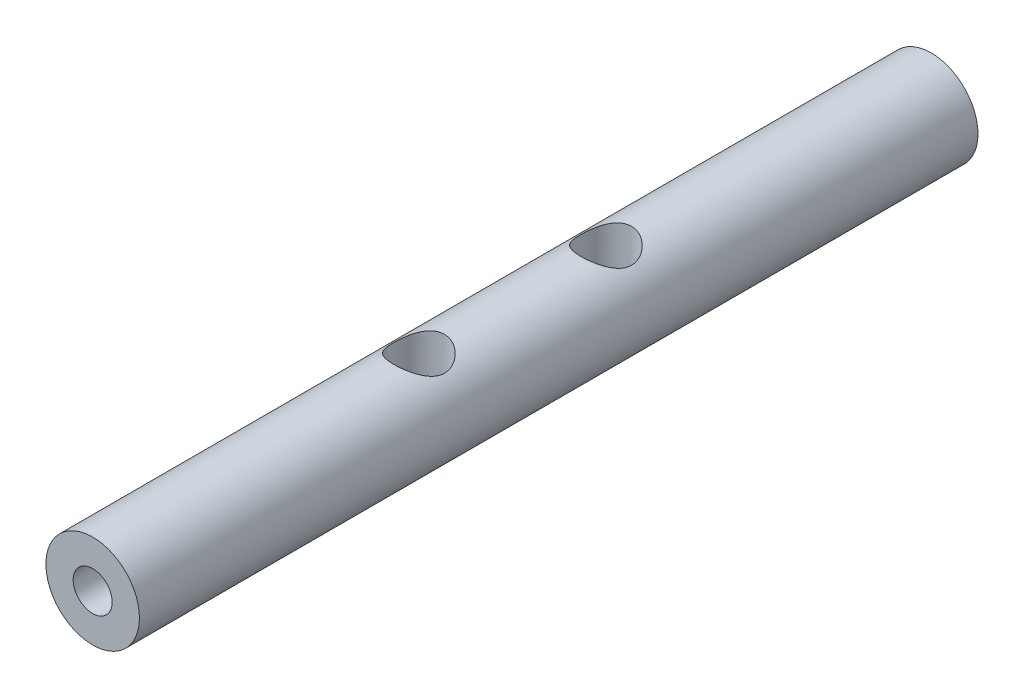
ISO-10303-21;
HEADER;
FILE_DESCRIPTION(('STEP AP214'),'2;1');
FILE_NAME('part.step','',(''),(''),'','','');
FILE_SCHEMA(('AUTOMOTIVE_DESIGN { 1 0 10303 214 1 1 1 1 }'));
ENDSEC;
DATA;
#1=APPLICATION_CONTEXT('core data for automotive mechanical design processes');
#2=APPLICATION_PROTOCOL_DEFINITION('international standard','automotive_design',2000,#1);
#3=PRODUCT_CONTEXT('',#1,'mechanical');
#4=PRODUCT('Part','Part','',(#3));
#5=PRODUCT_RELATED_PRODUCT_CATEGORY('part','',(#4));
#6=PRODUCT_DEFINITION_FORMATION('','',#4);
#7=PRODUCT_DEFINITION_CONTEXT('part definition',#1,'design');
#8=PRODUCT_DEFINITION('design','',#6,#7);
#9=PRODUCT_DEFINITION_SHAPE('','',#8);
#10=(LENGTH_UNIT() NAMED_UNIT(*) SI_UNIT(.MILLI.,.METRE.));
#11=(NAMED_UNIT(*) PLANE_ANGLE_UNIT() SI_UNIT($,.RADIAN.));
#12=(NAMED_UNIT(*) SI_UNIT($,.STERADIAN.) SOLID_ANGLE_UNIT());
#13=UNCERTAINTY_MEASURE_WITH_UNIT(LENGTH_MEASURE(1.E-05),#10,'distance_accuracy_value','');
#14=(GEOMETRIC_REPRESENTATION_CONTEXT(3) GLOBAL_UNCERTAINTY_ASSIGNED_CONTEXT((#13)) GLOBAL_UNIT_ASSIGNED_CONTEXT((#10,
#11,#12)) REPRESENTATION_CONTEXT('',''));
#15=CARTESIAN_POINT('',(0.,0.,0.));
#16=DIRECTION('',(0.,0.,1.));
#17=DIRECTION('',(1.,0.,0.));
#18=AXIS2_PLACEMENT_3D('',#15,#16,#17);
#19=CARTESIAN_POINT('',(0.,0.,53.8));
#20=DIRECTION('',(0.,0.,-1.));
#21=DIRECTION('',(-1.,0.,0.));
#22=AXIS2_PLACEMENT_3D('',#19,#20,#21);
#23=CYLINDRICAL_SURFACE('',#22,3.);
#24=CARTESIAN_POINT('',(-1.67418507985698,-2.48939838482801,32.9));
#25=CARTESIAN_POINT('',(-1.67417874792426,-2.48940739058473,32.9845622441242));
#26=CARTESIAN_POINT('',(-1.66768162039032,-2.49381038900441,33.0691984196438));
#27=CARTESIAN_POINT('',(-1.64207381243059,-2.51073943271135,33.2357580106561));
#28=CARTESIAN_POINT('',(-1.6229418667545,-2.52327917205968,33.3176766077371));
#29=CARTESIAN_POINT('',(-1.57320288394012,-2.55458050308205,33.4760581583417));
#30=CARTESIAN_POINT('',(-1.54266740017501,-2.57330321563424,33.5525516636398));
#31=CARTESIAN_POINT('',(-1.47119380414437,-2.61482174809998,33.6992707493233));
#32=CARTESIAN_POINT('',(-1.4302535240238,-2.63761841653423,33.7694950193788));
#33=CARTESIAN_POINT('',(-1.3342778342491,-2.68754754297471,33.9094930204861));
#34=CARTESIAN_POINT('',(-1.27823603774815,-2.71488534782135,33.9785038569203));
#35=CARTESIAN_POINT('',(-1.15569348346534,-2.76927248123174,34.1067154247562));
#36=CARTESIAN_POINT('',(-1.08918650640221,-2.79632162797831,34.1659102794456));
#37=CARTESIAN_POINT('',(-0.940625784082641,-2.84990744467537,34.277812787525));
#38=CARTESIAN_POINT('',(-0.857727483734366,-2.87620071495066,34.3295270891256));
#39=CARTESIAN_POINT('',(-0.682684010632217,-2.92268990867901,34.4178779061803));
#40=CARTESIAN_POINT('',(-0.590545950887645,-2.94289047516512,34.4545259108958));
#41=CARTESIAN_POINT('',(-0.407736299635145,-2.97348484942954,34.5084939847996));
#42=CARTESIAN_POINT('',(-0.317580176306482,-2.98455459598177,34.527168143272));
#43=CARTESIAN_POINT('',(-0.134810441981728,-2.9983663263465,34.5491747783519));
#44=CARTESIAN_POINT('',(-0.0421987477257337,-3.00111462317547,34.5525188859986));
#45=CARTESIAN_POINT('',(0.132429352758504,-2.99821425016596,34.5441598762631));
#46=CARTESIAN_POINT('',(0.214539773453571,-2.99341469963181,34.5339956989619));
#47=CARTESIAN_POINT('',(0.37573354194905,-2.97747948915032,34.5017438606667));
#48=CARTESIAN_POINT('',(0.454816656790294,-2.96634334262714,34.479655284026));
#49=CARTESIAN_POINT('',(0.60885125512767,-2.93862163898411,34.4241824045499));
#50=CARTESIAN_POINT('',(0.683749089382051,-2.92197870262914,34.3906790487451));
#51=CARTESIAN_POINT('',(0.827045974285331,-2.8846983403051,34.3135685538577));
#52=CARTESIAN_POINT('',(0.895442936238213,-2.86405963694208,34.2699581828149));
#53=CARTESIAN_POINT('',(1.03167649186099,-2.81804071928414,34.1685152499585));
#54=CARTESIAN_POINT('',(1.09865703409807,-2.79238919373229,34.1096560691274));
#55=CARTESIAN_POINT('',(1.22231271212904,-2.74052138418174,33.9820757945502));
#56=CARTESIAN_POINT('',(1.27897711218389,-2.71430454323987,33.9133445587415));
#57=CARTESIAN_POINT('',(1.38533740495156,-2.66170259771836,33.7607020457706));
#58=CARTESIAN_POINT('',(1.43398478700822,-2.63550478403824,33.6759878250235));
#59=CARTESIAN_POINT('',(1.51595850276516,-2.58922818184214,33.4979123412443));
#60=CARTESIAN_POINT('',(1.54930254915191,-2.56914232822605,33.4045612261049));
#61=CARTESIAN_POINT('',(1.59680433899241,-2.5398707484805,33.2196175660859));
#62=CARTESIAN_POINT('',(1.61229454946542,-2.52993547804829,33.1284922928188));
#63=CARTESIAN_POINT('',(1.62764852295886,-2.52009114078003,32.9444385673955));
#64=CARTESIAN_POINT('',(1.62753015522791,-2.52017060871508,32.8515122989948));
#65=CARTESIAN_POINT('',(1.61289089615575,-2.52955026942772,32.6810193032245));
#66=CARTESIAN_POINT('',(1.60046585342937,-2.53750858867493,32.6031832372118));
#67=CARTESIAN_POINT('',(1.56491807256443,-2.55958319011467,32.4509051572916));
#68=CARTESIAN_POINT('',(1.54179063920735,-2.57370217488172,32.3764646488028));
#69=CARTESIAN_POINT('',(1.48456367751867,-2.60714531993856,32.2294315856593));
#70=CARTESIAN_POINT('',(1.45004275925545,-2.62666379642748,32.157049179305));
#71=CARTESIAN_POINT('',(1.37137345744475,-2.66858034642967,32.018638467017));
#72=CARTESIAN_POINT('',(1.32722031090996,-2.69097984230528,31.9526133280174));
#73=CARTESIAN_POINT('',(1.22242441018721,-2.74035353776672,31.8178240171669));
#74=CARTESIAN_POINT('',(1.16027742558986,-2.76749024986919,31.7502833445464));
#75=CARTESIAN_POINT('',(1.02532772026233,-2.82027586545178,31.6260553654176));
#76=CARTESIAN_POINT('',(0.952518794792583,-2.84592389036791,31.5693744233941));
#77=CARTESIAN_POINT('',(0.79360034680166,-2.89437955925455,31.4658164352217));
#78=CARTESIAN_POINT('',(0.707004382975046,-2.91697795085138,31.4195801922183));
#79=CARTESIAN_POINT('',(0.525678555358574,-2.95503131680498,31.3427856946241));
#80=CARTESIAN_POINT('',(0.430957268763268,-2.9704937165935,31.3122111394385));
#81=CARTESIAN_POINT('',(0.246463961170265,-2.99115018242156,31.2706938816082));
#82=CARTESIAN_POINT('',(0.157170234763477,-2.99722957769689,31.2580690306557));
#83=CARTESIAN_POINT('',(-0.0224475607861199,-3.00125771646269,31.2475681065655));
#84=CARTESIAN_POINT('',(-0.112771062127573,-2.99921074319971,31.2496842641804));
#85=CARTESIAN_POINT('',(-0.283303701004868,-2.98770708487821,31.2676699284619));
#86=CARTESIAN_POINT('',(-0.363695460978917,-2.97892880625263,31.2822936667943));
#87=CARTESIAN_POINT('',(-0.520630838422349,-2.95554395862078,31.3229648219905));
#88=CARTESIAN_POINT('',(-0.597173995506868,-2.94093669418744,31.3490136019554));
#89=CARTESIAN_POINT('',(-0.747260971645303,-2.9064987829693,31.4126126320396));
#90=CARTESIAN_POINT('',(-0.820612829991331,-2.8865066559362,31.450525594045));
#91=CARTESIAN_POINT('',(-0.960119649881503,-2.84315230805189,31.5363255014877));
#92=CARTESIAN_POINT('',(-1.02627168433711,-2.81978872544686,31.5842164805995));
#93=CARTESIAN_POINT('',(-1.15758729979251,-2.7686652636432,31.6949260016504));
#94=CARTESIAN_POINT('',(-1.22176243656416,-2.74070878837433,31.7588278337257));
#95=CARTESIAN_POINT('',(-1.33897177517596,-2.68539850118267,31.8965071375519));
#96=CARTESIAN_POINT('',(-1.39199240252005,-2.65804545941396,31.9702964652734));
#97=CARTESIAN_POINT('',(-1.48875697605896,-2.60515655975889,32.1317240000514));
#98=CARTESIAN_POINT('',(-1.53165134557677,-2.57986190765574,32.2199563985927));
#99=CARTESIAN_POINT('',(-1.60144491637929,-2.53713990963379,32.4041788004087));
#100=CARTESIAN_POINT('',(-1.62839509530135,-2.51968753347401,32.5001429528282));
#101=CARTESIAN_POINT('',(-1.65569872000885,-2.5017532712973,32.6478087830585));
#102=CARTESIAN_POINT('',(-1.66261401752616,-2.49714746169083,32.69787476416));
#103=CARTESIAN_POINT('',(-1.67185904495401,-2.49096735210302,32.7986183124075));
#104=CARTESIAN_POINT('',(-1.6741888765297,-2.48939298491105,32.8492958659691));
#105=CARTESIAN_POINT('',(-1.67418507985698,-2.48939838482801,32.9));
#106=B_SPLINE_CURVE_WITH_KNOTS('',3,(#24,#25,#26,#27,#28,#29,#30,#31,#32,#33,#34,#35,#36,#37,
#38,#39,#40,#41,#42,#43,#44,#45,#46,#47,#48,#49,#50,#51,#52,#53,#54,#55,#56,#57,#58,#59,#60,#61,
#62,#63,#64,#65,#66,#67,#68,#69,#70,#71,#72,#73,#74,#75,#76,#77,#78,#79,#80,#81,#82,#83,#84,#85,
#86,#87,#88,#89,#90,#91,#92,#93,#94,#95,#96,#97,#98,#99,#100,#101,#102,#103,#104,#105),
.UNSPECIFIED.,.T.,.F.,(4,2,2,2,2,2,2,2,2,2,2,2,2,2,2,2,2,2,2,2,2,2,2,2,2,2,2,2,2,2,2,2,2,2,2,2,
2,2,2,2,4),(0.,0.253471464978924,0.507370630471961,0.759702723718418,1.0120874338999,
1.28998079678324,1.56803993512379,1.86997289364919,2.17167517502775,2.44828286528194,
2.72468065617496,2.97213663093978,3.21961160997026,3.46975098230536,3.71997045333203,
3.99717687977861,4.27467015892954,4.57652503396564,4.87802964361057,5.15517475627459,
5.43200258623575,5.66859462056204,5.90529054812096,6.15196333618104,6.39875837770519,
6.68465599353127,6.9707206542103,7.27125286686228,7.57147164850529,7.84111747203328,
8.11062118950825,8.35604451303949,8.60149712555493,8.855339906974,9.10928550569669,
9.39243346006442,9.67592402360681,9.97823556729928,10.279575245972,10.4315619419379,
10.583545268142),.UNSPECIFIED.);
#107=CARTESIAN_POINT('',(-1.67418507985698,-2.48939838482801,32.9));
#108=VERTEX_POINT('',#107);
#109=EDGE_CURVE('E41',#108,#108,#106,.T.);
#110=ORIENTED_EDGE('',*,*,#109,.T.);
#111=EDGE_LOOP('',(#110));
#112=FACE_BOUND('',#111,.T.);
#113=CARTESIAN_POINT('',(-1.62566018942524,2.52135458603463,32.9));
#114=CARTESIAN_POINT('',(-1.6256536842702,2.52136346747506,32.8154377558758));
#115=CARTESIAN_POINT('',(-1.61907250464969,2.52563981358811,32.7308015803562));
#116=CARTESIAN_POINT('',(-1.59314164328522,2.54206974901801,32.5642419893439));
#117=CARTESIAN_POINT('',(-1.57377043507337,2.55423661799445,32.4823233922629));
#118=CARTESIAN_POINT('',(-1.52343458389827,2.58456880917247,32.3239418416583));
#119=CARTESIAN_POINT('',(-1.4925422338405,2.60269664528132,32.2474483363602));
#120=CARTESIAN_POINT('',(-1.42027797443758,2.64282319859216,32.1007292506767));
#121=CARTESIAN_POINT('',(-1.37890388121111,2.66482272217197,32.0305049806212));
#122=CARTESIAN_POINT('',(-1.28197923972725,2.71288377259812,31.8905069795139));
#123=CARTESIAN_POINT('',(-1.22541851652206,2.73913111759515,31.8214961430797));
#124=CARTESIAN_POINT('',(-1.10184565715998,2.79113483207626,31.6932845752439));
#125=CARTESIAN_POINT('',(-1.03482730640939,2.81689089933164,31.6340897205544));
#126=CARTESIAN_POINT('',(-0.885256677354983,2.86758956688289,31.522187212475));
#127=CARTESIAN_POINT('',(-0.801864716150481,2.89227245708783,31.4704729108744));
#128=CARTESIAN_POINT('',(-0.625953739753542,2.93536295479036,31.3821220938197));
#129=CARTESIAN_POINT('',(-0.533441746317141,2.95377534220419,31.3454740891043));
#130=CARTESIAN_POINT('',(-0.350073875108627,2.98082359789934,31.2915060152004));
#131=CARTESIAN_POINT('',(-0.259720278281573,2.99014526099119,31.2728318567281));
#132=CARTESIAN_POINT('',(-0.0767173373621651,3.0004147933884,31.2508252216481));
#133=CARTESIAN_POINT('',(0.0159302126105213,3.00136901164676,31.2474811140014));
#134=CARTESIAN_POINT('',(0.190469391910898,2.99508724983352,31.2558401237369));
#135=CARTESIAN_POINT('',(0.272471462530794,2.98869840908574,31.266004301038));
#136=CARTESIAN_POINT('',(0.433326390419499,2.96964443026812,31.2982561393333));
#137=CARTESIAN_POINT('',(0.51217900534957,2.95697881022529,31.320344715974));
#138=CARTESIAN_POINT('',(0.665647842806608,2.92627919675193,31.3758175954501));
#139=CARTESIAN_POINT('',(0.740209314919446,2.90818887384495,31.4093209512549));
#140=CARTESIAN_POINT('',(0.882757335143963,2.8681403461808,31.4864314461423));
#141=CARTESIAN_POINT('',(0.950741770212723,2.84618090471995,31.5300418171851));
#142=CARTESIAN_POINT('',(1.08605855075542,2.79753225249203,31.6314847500415));
#143=CARTESIAN_POINT('',(1.15252975100144,2.77058836006047,31.6903439308726));
#144=CARTESIAN_POINT('',(1.27515774042167,2.71633550218531,31.8179242054498));
#145=CARTESIAN_POINT('',(1.33130378508428,2.68902618781653,31.8866554412585));
#146=CARTESIAN_POINT('',(1.43662541532149,2.63437428250257,32.0392979542294));
#147=CARTESIAN_POINT('',(1.48475631405271,2.60723925329842,32.1240121749765));
#148=CARTESIAN_POINT('',(1.56581844060922,2.55938378732062,32.3020876587557));
#149=CARTESIAN_POINT('',(1.59876724097284,2.53865594373942,32.3954387738951));
#150=CARTESIAN_POINT('',(1.64569323429219,2.50846991104474,32.5803824339141));
#151=CARTESIAN_POINT('',(1.66098812832599,2.49823651299941,32.6715077071812));
#152=CARTESIAN_POINT('',(1.67614857198709,2.48809666949534,32.8555614326045));
#153=CARTESIAN_POINT('',(1.67603176547046,2.48817841489341,32.9484877010052));
#154=CARTESIAN_POINT('',(1.66157690303512,2.49783982748377,33.1189806967755));
#155=CARTESIAN_POINT('',(1.64930831528333,2.50603728358732,33.1968167627882));
#156=CARTESIAN_POINT('',(1.61419470880551,2.5287961806007,33.3490948427084));
#157=CARTESIAN_POINT('',(1.5913450480809,2.54336041450808,33.4235353511972));
#158=CARTESIAN_POINT('',(1.53477649541337,2.57790557255535,33.5705684143407));
#159=CARTESIAN_POINT('',(1.50064005579172,2.59808893729322,33.642950820695));
#160=CARTESIAN_POINT('',(1.422797284553,2.6415211739078,33.781361532983));
#161=CARTESIAN_POINT('',(1.37908621838808,2.66477156012244,33.8473866719826));
#162=CARTESIAN_POINT('',(1.27526616693577,2.71616552405061,33.982175982833));
#163=CARTESIAN_POINT('',(1.21365638065084,2.74450071545991,34.0497166554536));
#164=CARTESIAN_POINT('',(1.07975425678434,2.7998899328624,34.1739446345824));
#165=CARTESIAN_POINT('',(1.00745569861218,2.82694320062038,34.2306255766059));
#166=CARTESIAN_POINT('',(0.849505471517208,2.87846747373262,34.3341835647783));
#167=CARTESIAN_POINT('',(0.763363400036767,2.90273868661706,34.3804198077817));
#168=CARTESIAN_POINT('',(0.582808539715165,2.94429655994384,34.4572143053759));
#169=CARTESIAN_POINT('',(0.488404470264447,2.96159047831517,34.4877888605615));
#170=CARTESIAN_POINT('',(0.304345807188164,2.98581605722845,34.5293061183918));
#171=CARTESIAN_POINT('',(0.215186564167075,2.99362361807871,34.5419309693443));
#172=CARTESIAN_POINT('',(0.0356804664689837,3.00112956700051,34.5524318934345));
#173=CARTESIAN_POINT('',(-0.0546657375617162,3.00083222651896,34.5503157358196));
#174=CARTESIAN_POINT('',(-0.225389178830067,2.99263334374607,34.5323300715381));
#175=CARTESIAN_POINT('',(-0.305935865906382,2.9854136174089,34.5177063332057));
#176=CARTESIAN_POINT('',(-0.463294692773116,2.96507244243786,34.4770351780095));
#177=CARTESIAN_POINT('',(-0.540106385732993,2.95195028959132,34.4509863980446));
#178=CARTESIAN_POINT('',(-0.690832154706123,2.92042549454192,34.3873873679604));
#179=CARTESIAN_POINT('',(-0.764557433318391,2.90185768477159,34.349474405955));
#180=CARTESIAN_POINT('',(-0.904877710381227,2.8612132248619,34.2636744985123));
#181=CARTESIAN_POINT('',(-0.971469808664617,2.83913515653667,34.2157835194005));
#182=CARTESIAN_POINT('',(-1.10375087797698,2.79056440493862,34.1050739983496));
#183=CARTESIAN_POINT('',(-1.16845539753368,2.76385601977489,34.0411721662743));
#184=CARTESIAN_POINT('',(-1.28671391970394,2.71082603899847,33.9034928624481));
#185=CARTESIAN_POINT('',(-1.34025433545212,2.68450495050512,33.8297035347266));
#186=CARTESIAN_POINT('',(-1.43802503315482,2.63349995987072,33.6682759999485));
#187=CARTESIAN_POINT('',(-1.48140122646018,2.60904076495989,33.5800436014073));
#188=CARTESIAN_POINT('',(-1.55200908261987,2.56767843561437,33.3958211995913));
#189=CARTESIAN_POINT('',(-1.57929219829861,2.55075126289079,33.2998570471718));
#190=CARTESIAN_POINT('',(-1.60693802591382,2.53334913953009,33.1521912169415));
#191=CARTESIAN_POINT('',(-1.61394122483089,2.52887811875045,33.10212523584));
#192=CARTESIAN_POINT('',(-1.62330420538177,2.52287821192929,33.0013816875925));
#193=CARTESIAN_POINT('',(-1.62566408996332,2.52134926065863,32.9507041340309));
#194=CARTESIAN_POINT('',(-1.62566018942524,2.52135458603463,32.9));
#195=B_SPLINE_CURVE_WITH_KNOTS('',3,(#113,#114,#115,#116,#117,#118,#119,#120,#121,#122,#123,
#124,#125,#126,#127,#128,#129,#130,#131,#132,#133,#134,#135,#136,#137,#138,#139,#140,#141,#142,
#143,#144,#145,#146,#147,#148,#149,#150,#151,#152,#153,#154,#155,#156,#157,#158,#159,#160,#161,
#162,#163,#164,#165,#166,#167,#168,#169,#170,#171,#172,#173,#174,#175,#176,#177,#178,#179,#180,
#181,#182,#183,#184,#185,#186,#187,#188,#189,#190,#191,#192,#193,#194),.UNSPECIFIED.,.T.,.F.,(4,
2,2,2,2,2,2,2,2,2,2,2,2,2,2,2,2,2,2,2,2,2,2,2,2,2,2,2,2,2,2,2,2,2,2,2,2,2,2,2,4),(0.,
0.253471464978924,0.507370630471962,0.759702723718419,1.0120874338999,1.28998079678323,
1.56803993512378,1.86997289364918,2.17167517502775,2.44828286528194,2.72468065617496,
2.97213663093978,3.21961160997025,3.46975098230535,3.71997045333202,3.99717687977861,
4.27467015892954,4.57652503396563,4.87802964361057,5.15517475627459,5.43200258623575,
5.66859462056203,5.90529054812095,6.15196333618103,6.39875837770518,6.68465599353126,
6.9707206542103,7.27125286686227,7.57147164850529,7.84111747203328,8.11062118950825,
8.35604451303949,8.60149712555493,8.855339906974,9.10928550569669,9.39243346006442,
9.67592402360681,9.97823556729927,10.279575245972,10.4315619419379,10.583545268142),.UNSPECIFIED.);
#196=CARTESIAN_POINT('',(-1.62566018942524,2.52135458603463,32.9));
#197=VERTEX_POINT('',#196);
#198=EDGE_CURVE('E11',#197,#197,#195,.T.);
#199=ORIENTED_EDGE('',*,*,#198,.T.);
#200=EDGE_LOOP('',(#199));
#201=FACE_BOUND('',#200,.T.);
#202=CARTESIAN_POINT('',(-1.67418507985698,-2.489398384828,20.9));
#203=CARTESIAN_POINT('',(-1.67417874792426,-2.48940739058473,20.9845622441242));
#204=CARTESIAN_POINT('',(-1.66768162039032,-2.49381038900441,21.0691984196437));
#205=CARTESIAN_POINT('',(-1.64207381243059,-2.51073943271135,21.2357580106561));
#206=CARTESIAN_POINT('',(-1.6229418667545,-2.52327917205968,21.3176766077371));
#207=CARTESIAN_POINT('',(-1.57320288394012,-2.55458050308205,21.4760581583416));
#208=CARTESIAN_POINT('',(-1.54266740017501,-2.57330321563424,21.5525516636398));
#209=CARTESIAN_POINT('',(-1.47119380414437,-2.61482174809998,21.6992707493233));
#210=CARTESIAN_POINT('',(-1.43025352402381,-2.63761841653423,21.7694950193788));
#211=CARTESIAN_POINT('',(-1.3342778342491,-2.68754754297471,21.9094930204861));
#212=CARTESIAN_POINT('',(-1.27823603774815,-2.71488534782135,21.9785038569203));
#213=CARTESIAN_POINT('',(-1.15569348346535,-2.76927248123174,22.1067154247562));
#214=CARTESIAN_POINT('',(-1.08918650640222,-2.79632162797831,22.1659102794456));
#215=CARTESIAN_POINT('',(-0.940625784082646,-2.84990744467537,22.277812787525));
#216=CARTESIAN_POINT('',(-0.85772748373437,-2.87620071495066,22.3295270891256));
#217=CARTESIAN_POINT('',(-0.682684010632218,-2.92268990867901,22.4178779061803));
#218=CARTESIAN_POINT('',(-0.590545950887645,-2.94289047516512,22.4545259108958));
#219=CARTESIAN_POINT('',(-0.407736299635143,-2.97348484942954,22.5084939847996));
#220=CARTESIAN_POINT('',(-0.31758017630648,-2.98455459598177,22.5271681432719));
#221=CARTESIAN_POINT('',(-0.134810441981726,-2.9983663263465,22.5491747783519));
#222=CARTESIAN_POINT('',(-0.0421987477257311,-3.00111462317547,22.5525188859986));
#223=CARTESIAN_POINT('',(0.132429352758507,-2.99821425016596,22.5441598762631));
#224=CARTESIAN_POINT('',(0.214539773453574,-2.99341469963181,22.533995698962));
#225=CARTESIAN_POINT('',(0.375733541949052,-2.97747948915032,22.5017438606667));
#226=CARTESIAN_POINT('',(0.454816656790295,-2.96634334262714,22.479655284026));
#227=CARTESIAN_POINT('',(0.608851255127672,-2.93862163898411,22.4241824045499));
#228=CARTESIAN_POINT('',(0.683749089382054,-2.92197870262914,22.3906790487451));
#229=CARTESIAN_POINT('',(0.827045974285334,-2.8846983403051,22.3135685538577));
#230=CARTESIAN_POINT('',(0.895442936238214,-2.86405963694208,22.2699581828149));
#231=CARTESIAN_POINT('',(1.031676491861,-2.81804071928414,22.1685152499585));
#232=CARTESIAN_POINT('',(1.09865703409807,-2.79238919373229,22.1096560691274));
#233=CARTESIAN_POINT('',(1.22231271212904,-2.74052138418174,21.9820757945502));
#234=CARTESIAN_POINT('',(1.27897711218389,-2.71430454323987,21.9133445587415));
#235=CARTESIAN_POINT('',(1.38533740495156,-2.66170259771836,21.7607020457706));
#236=CARTESIAN_POINT('',(1.43398478700822,-2.63550478403824,21.6759878250235));
#237=CARTESIAN_POINT('',(1.51595850276516,-2.58922818184214,21.4979123412443));
#238=CARTESIAN_POINT('',(1.54930254915191,-2.56914232822605,21.4045612261049));
#239=CARTESIAN_POINT('',(1.59680433899241,-2.5398707484805,21.2196175660859));
#240=CARTESIAN_POINT('',(1.61229454946543,-2.52993547804829,21.1284922928188));
#241=CARTESIAN_POINT('',(1.62764852295886,-2.52009114078003,20.9444385673954));
#242=CARTESIAN_POINT('',(1.62753015522791,-2.52017060871508,20.8515122989948));
#243=CARTESIAN_POINT('',(1.61289089615575,-2.52955026942772,20.6810193032245));
#244=CARTESIAN_POINT('',(1.60046585342937,-2.53750858867493,20.6031832372118));
#245=CARTESIAN_POINT('',(1.56491807256443,-2.55958319011467,20.4509051572916));
#246=CARTESIAN_POINT('',(1.54179063920735,-2.57370217488172,20.3764646488028));
#247=CARTESIAN_POINT('',(1.48456367751867,-2.60714531993856,20.2294315856593));
#248=CARTESIAN_POINT('',(1.45004275925545,-2.62666379642748,20.157049179305));
#249=CARTESIAN_POINT('',(1.37137345744475,-2.66858034642967,20.018638467017));
#250=CARTESIAN_POINT('',(1.32722031090996,-2.69097984230528,19.9526133280174));
#251=CARTESIAN_POINT('',(1.22242441018722,-2.74035353776672,19.8178240171669));
#252=CARTESIAN_POINT('',(1.16027742558986,-2.76749024986919,19.7502833445464));
#253=CARTESIAN_POINT('',(1.02532772026233,-2.82027586545178,19.6260553654176));
#254=CARTESIAN_POINT('',(0.952518794792583,-2.84592389036791,19.5693744233941));
#255=CARTESIAN_POINT('',(0.793600346801659,-2.89437955925456,19.4658164352217));
#256=CARTESIAN_POINT('',(0.707004382975045,-2.91697795085138,19.4195801922183));
#257=CARTESIAN_POINT('',(0.525678555358573,-2.95503131680498,19.3427856946241));
#258=CARTESIAN_POINT('',(0.430957268763267,-2.9704937165935,19.3122111394385));
#259=CARTESIAN_POINT('',(0.246463961170264,-2.99115018242156,19.2706938816082));
#260=CARTESIAN_POINT('',(0.157170234763476,-2.99722957769689,19.2580690306557));
#261=CARTESIAN_POINT('',(-0.0224475607861208,-3.00125771646269,19.2475681065655));
#262=CARTESIAN_POINT('',(-0.112771062127574,-2.99921074319971,19.2496842641804));
#263=CARTESIAN_POINT('',(-0.283303701004869,-2.98770708487821,19.2676699284619));
#264=CARTESIAN_POINT('',(-0.363695460978917,-2.97892880625263,19.2822936667944));
#265=CARTESIAN_POINT('',(-0.52063083842235,-2.95554395862078,19.3229648219905));
#266=CARTESIAN_POINT('',(-0.597173995506869,-2.94093669418744,19.3490136019554));
#267=CARTESIAN_POINT('',(-0.747260971645304,-2.9064987829693,19.4126126320396));
#268=CARTESIAN_POINT('',(-0.820612829991333,-2.8865066559362,19.450525594045));
#269=CARTESIAN_POINT('',(-0.960119649881505,-2.84315230805189,19.5363255014877));
#270=CARTESIAN_POINT('',(-1.02627168433711,-2.81978872544686,19.5842164805995));
#271=CARTESIAN_POINT('',(-1.15758729979252,-2.76866526364319,19.6949260016504));
#272=CARTESIAN_POINT('',(-1.22176243656416,-2.74070878837433,19.7588278337257));
#273=CARTESIAN_POINT('',(-1.33897177517597,-2.68539850118267,19.8965071375519));
#274=CARTESIAN_POINT('',(-1.39199240252006,-2.65804545941396,19.9702964652734));
#275=CARTESIAN_POINT('',(-1.48875697605896,-2.60515655975889,20.1317240000515));
#276=CARTESIAN_POINT('',(-1.53165134557677,-2.57986190765574,20.2199563985927));
#277=CARTESIAN_POINT('',(-1.60144491637929,-2.53713990963379,20.4041788004087));
#278=CARTESIAN_POINT('',(-1.62839509530135,-2.51968753347401,20.5001429528282));
#279=CARTESIAN_POINT('',(-1.65569872000885,-2.5017532712973,20.6478087830585));
#280=CARTESIAN_POINT('',(-1.66261401752617,-2.49714746169083,20.69787476416));
#281=CARTESIAN_POINT('',(-1.67185904495401,-2.49096735210302,20.7986183124075));
#282=CARTESIAN_POINT('',(-1.6741888765297,-2.48939298491105,20.8492958659691));
#283=CARTESIAN_POINT('',(-1.67418507985698,-2.489398384828,20.9));
#284=B_SPLINE_CURVE_WITH_KNOTS('',3,(#202,#203,#204,#205,#206,#207,#208,#209,#210,#211,#212,
#213,#214,#215,#216,#217,#218,#219,#220,#221,#222,#223,#224,#225,#226,#227,#228,#229,#230,#231,
#232,#233,#234,#235,#236,#237,#238,#239,#240,#241,#242,#243,#244,#245,#246,#247,#248,#249,#250,
#251,#252,#253,#254,#255,#256,#257,#258,#259,#260,#261,#262,#263,#264,#265,#266,#267,#268,#269,
#270,#271,#272,#273,#274,#275,#276,#277,#278,#279,#280,#281,#282,#283),.UNSPECIFIED.,.T.,.F.,(4,
2,2,2,2,2,2,2,2,2,2,2,2,2,2,2,2,2,2,2,2,2,2,2,2,2,2,2,2,2,2,2,2,2,2,2,2,2,2,2,4),(0.,
0.253471464978914,0.507370630471961,0.759702723718411,1.0120874338999,1.28998079678323,
1.56803993512378,1.86997289364919,2.17167517502775,2.44828286528194,2.72468065617496,
2.97213663093978,3.21961160997026,3.46975098230536,3.71997045333203,3.99717687977861,
4.27467015892954,4.57652503396564,4.87802964361058,5.1551747562746,5.43200258623576,
5.66859462056205,5.90529054812097,6.15196333618105,6.3987583777052,6.68465599353128,
6.97072065421031,7.27125286686229,7.5714716485053,7.84111747203329,8.11062118950826,
8.3560445130395,8.60149712555494,8.85533990697401,9.1092855056967,9.39243346006443,
9.67592402360683,9.97823556729928,10.279575245972,10.4315619419379,10.5835452681421),.UNSPECIFIED.);
#285=CARTESIAN_POINT('',(-1.67418507985698,-2.489398384828,20.9));
#286=VERTEX_POINT('',#285);
#287=EDGE_CURVE('E83',#286,#286,#284,.T.);
#288=ORIENTED_EDGE('',*,*,#287,.T.);
#289=EDGE_LOOP('',(#288));
#290=FACE_BOUND('',#289,.T.);
#291=CARTESIAN_POINT('',(-1.62566018942525,2.52135458603463,20.9));
#292=CARTESIAN_POINT('',(-1.6256536842702,2.52136346747506,20.8154377558758));
#293=CARTESIAN_POINT('',(-1.61907250464969,2.52563981358811,20.7308015803563));
#294=CARTESIAN_POINT('',(-1.59314164328523,2.54206974901801,20.5642419893439));
#295=CARTESIAN_POINT('',(-1.57377043507337,2.55423661799445,20.4823233922629));
#296=CARTESIAN_POINT('',(-1.52343458389827,2.58456880917246,20.3239418416584));
#297=CARTESIAN_POINT('',(-1.49254223384051,2.60269664528132,20.2474483363602));
#298=CARTESIAN_POINT('',(-1.42027797443759,2.64282319859216,20.1007292506767));
#299=CARTESIAN_POINT('',(-1.37890388121111,2.66482272217196,20.0305049806212));
#300=CARTESIAN_POINT('',(-1.28197923972725,2.71288377259811,19.8905069795139));
#301=CARTESIAN_POINT('',(-1.22541851652206,2.73913111759514,19.8214961430797));
#302=CARTESIAN_POINT('',(-1.10184565715999,2.79113483207626,19.6932845752439));
#303=CARTESIAN_POINT('',(-1.03482730640939,2.81689089933164,19.6340897205544));
#304=CARTESIAN_POINT('',(-0.885256677354989,2.86758956688289,19.522187212475));
#305=CARTESIAN_POINT('',(-0.801864716150488,2.89227245708783,19.4704729108744));
#306=CARTESIAN_POINT('',(-0.62595373975355,2.93536295479036,19.3821220938197));
#307=CARTESIAN_POINT('',(-0.533441746317148,2.95377534220419,19.3454740891043));
#308=CARTESIAN_POINT('',(-0.350073875108634,2.98082359789934,19.2915060152004));
#309=CARTESIAN_POINT('',(-0.25972027828158,2.99014526099119,19.2728318567281));
#310=CARTESIAN_POINT('',(-0.0767173373621731,3.00041479338841,19.2508252216481));
#311=CARTESIAN_POINT('',(0.0159302126105133,3.00136901164676,19.2474811140014));
#312=CARTESIAN_POINT('',(0.190469391910891,2.99508724983352,19.2558401237369));
#313=CARTESIAN_POINT('',(0.272471462530787,2.98869840908574,19.266004301038));
#314=CARTESIAN_POINT('',(0.433326390419493,2.96964443026812,19.2982561393333));
#315=CARTESIAN_POINT('',(0.512179005349563,2.95697881022529,19.320344715974));
#316=CARTESIAN_POINT('',(0.665647842806602,2.92627919675193,19.3758175954501));
#317=CARTESIAN_POINT('',(0.740209314919441,2.90818887384495,19.4093209512549));
#318=CARTESIAN_POINT('',(0.882757335143959,2.8681403461808,19.4864314461423));
#319=CARTESIAN_POINT('',(0.950741770212718,2.84618090471995,19.5300418171851));
#320=CARTESIAN_POINT('',(1.08605855075542,2.79753225249203,19.6314847500415));
#321=CARTESIAN_POINT('',(1.15252975100144,2.77058836006048,19.6903439308726));
#322=CARTESIAN_POINT('',(1.27515774042167,2.71633550218531,19.8179242054498));
#323=CARTESIAN_POINT('',(1.33130378508428,2.68902618781653,19.8866554412585));
#324=CARTESIAN_POINT('',(1.43662541532149,2.63437428250257,20.0392979542294));
#325=CARTESIAN_POINT('',(1.48475631405271,2.60723925329842,20.1240121749765));
#326=CARTESIAN_POINT('',(1.56581844060922,2.55938378732062,20.3020876587557));
#327=CARTESIAN_POINT('',(1.59876724097284,2.53865594373942,20.3954387738951));
#328=CARTESIAN_POINT('',(1.64569323429219,2.50846991104474,20.580382433914));
#329=CARTESIAN_POINT('',(1.66098812832599,2.49823651299941,20.6715077071812));
#330=CARTESIAN_POINT('',(1.67614857198709,2.48809666949534,20.8555614326045));
#331=CARTESIAN_POINT('',(1.67603176547046,2.48817841489341,20.9484877010052));
#332=CARTESIAN_POINT('',(1.66157690303512,2.49783982748377,21.1189806967755));
#333=CARTESIAN_POINT('',(1.64930831528333,2.50603728358732,21.1968167627882));
#334=CARTESIAN_POINT('',(1.61419470880551,2.5287961806007,21.3490948427084));
#335=CARTESIAN_POINT('',(1.5913450480809,2.54336041450807,21.4235353511972));
#336=CARTESIAN_POINT('',(1.53477649541337,2.57790557255535,21.5705684143407));
#337=CARTESIAN_POINT('',(1.50064005579172,2.59808893729322,21.642950820695));
#338=CARTESIAN_POINT('',(1.422797284553,2.6415211739078,21.781361532983));
#339=CARTESIAN_POINT('',(1.37908621838808,2.66477156012244,21.8473866719826));
#340=CARTESIAN_POINT('',(1.27526616693577,2.71616552405061,21.982175982833));
#341=CARTESIAN_POINT('',(1.21365638065085,2.74450071545991,22.0497166554536));
#342=CARTESIAN_POINT('',(1.07975425678434,2.7998899328624,22.1739446345824));
#343=CARTESIAN_POINT('',(1.00745569861218,2.82694320062038,22.2306255766059));
#344=CARTESIAN_POINT('',(0.849505471517215,2.87846747373261,22.3341835647783));
#345=CARTESIAN_POINT('',(0.763363400036774,2.90273868661706,22.3804198077817));
#346=CARTESIAN_POINT('',(0.582808539715174,2.94429655994383,22.4572143053759));
#347=CARTESIAN_POINT('',(0.488404470264456,2.96159047831517,22.4877888605615));
#348=CARTESIAN_POINT('',(0.304345807188173,2.98581605722845,22.5293061183918));
#349=CARTESIAN_POINT('',(0.215186564167084,2.99362361807871,22.5419309693443));
#350=CARTESIAN_POINT('',(0.0356804664689931,3.00112956700051,22.5524318934345));
#351=CARTESIAN_POINT('',(-0.0546657375617073,3.00083222651896,22.5503157358196));
#352=CARTESIAN_POINT('',(-0.225389178830058,2.99263334374607,22.5323300715381));
#353=CARTESIAN_POINT('',(-0.305935865906372,2.9854136174089,22.5177063332057));
#354=CARTESIAN_POINT('',(-0.463294692773106,2.96507244243786,22.4770351780095));
#355=CARTESIAN_POINT('',(-0.540106385732985,2.95195028959132,22.4509863980446));
#356=CARTESIAN_POINT('',(-0.690832154706114,2.92042549454192,22.3873873679604));
#357=CARTESIAN_POINT('',(-0.764557433318382,2.9018576847716,22.349474405955));
#358=CARTESIAN_POINT('',(-0.904877710381219,2.8612132248619,22.2636744985123));
#359=CARTESIAN_POINT('',(-0.971469808664611,2.83913515653667,22.2157835194005));
#360=CARTESIAN_POINT('',(-1.10375087797697,2.79056440493862,22.1050739983496));
#361=CARTESIAN_POINT('',(-1.16845539753368,2.76385601977489,22.0411721662743));
#362=CARTESIAN_POINT('',(-1.28671391970394,2.71082603899847,21.9034928624481));
#363=CARTESIAN_POINT('',(-1.34025433545211,2.68450495050513,21.8297035347266));
#364=CARTESIAN_POINT('',(-1.43802503315482,2.63349995987072,21.6682759999486));
#365=CARTESIAN_POINT('',(-1.48140122646018,2.6090407649599,21.5800436014073));
#366=CARTESIAN_POINT('',(-1.55200908261987,2.56767843561437,21.3958211995913));
#367=CARTESIAN_POINT('',(-1.57929219829861,2.55075126289079,21.2998570471718));
#368=CARTESIAN_POINT('',(-1.60693802591382,2.53334913953009,21.1521912169415));
#369=CARTESIAN_POINT('',(-1.61394122483089,2.52887811875045,21.10212523584));
#370=CARTESIAN_POINT('',(-1.62330420538177,2.52287821192928,21.0013816875925));
#371=CARTESIAN_POINT('',(-1.62566408996333,2.52134926065863,20.9507041340309));
#372=CARTESIAN_POINT('',(-1.62566018942525,2.52135458603463,20.9));
#373=B_SPLINE_CURVE_WITH_KNOTS('',3,(#291,#292,#293,#294,#295,#296,#297,#298,#299,#300,#301,
#302,#303,#304,#305,#306,#307,#308,#309,#310,#311,#312,#313,#314,#315,#316,#317,#318,#319,#320,
#321,#322,#323,#324,#325,#326,#327,#328,#329,#330,#331,#332,#333,#334,#335,#336,#337,#338,#339,
#340,#341,#342,#343,#344,#345,#346,#347,#348,#349,#350,#351,#352,#353,#354,#355,#356,#357,#358,
#359,#360,#361,#362,#363,#364,#365,#366,#367,#368,#369,#370,#371,#372),.UNSPECIFIED.,.T.,.F.,(4,
2,2,2,2,2,2,2,2,2,2,2,2,2,2,2,2,2,2,2,2,2,2,2,2,2,2,2,2,2,2,2,2,2,2,2,2,2,2,2,4),(0.,
0.25347146497891,0.507370630471958,0.759702723718407,1.01208743389989,1.28998079678323,
1.56803993512378,1.86997289364918,2.17167517502774,2.44828286528193,2.72468065617495,
2.97213663093977,3.21961160997025,3.46975098230535,3.71997045333202,3.9971768797786,
4.27467015892953,4.57652503396563,4.87802964361057,5.15517475627458,5.43200258623575,
5.66859462056204,5.90529054812096,6.15196333618104,6.39875837770519,6.68465599353127,
6.9707206542103,7.27125286686228,7.57147164850528,7.84111747203328,8.11062118950825,
8.35604451303949,8.60149712555493,8.855339906974,9.10928550569669,9.39243346006442,
9.67592402360681,9.97823556729928,10.279575245972,10.4315619419379,10.5835452681421),.UNSPECIFIED.);
#374=CARTESIAN_POINT('',(-1.62566018942525,2.52135458603463,20.9));
#375=VERTEX_POINT('',#374);
#376=EDGE_CURVE('E50',#375,#375,#373,.T.);
#377=ORIENTED_EDGE('',*,*,#376,.T.);
#378=EDGE_LOOP('',(#377));
#379=FACE_BOUND('',#378,.T.);
#380=CARTESIAN_POINT('',(0.,0.,53.8));
#381=DIRECTION('',(0.,0.,1.));
#382=DIRECTION('',(1.,0.,0.));
#383=AXIS2_PLACEMENT_3D('',#380,#381,#382);
#384=CIRCLE('',#383,3.);
#385=CARTESIAN_POINT('',(3.,0.,53.8));
#386=VERTEX_POINT('',#385);
#387=EDGE_CURVE('E77',#386,#386,#384,.T.);
#388=ORIENTED_EDGE('',*,*,#387,.F.);
#389=EDGE_LOOP('',(#388));
#390=FACE_BOUND('',#389,.T.);
#391=CARTESIAN_POINT('',(0.,0.,0.));
#392=DIRECTION('',(0.,0.,1.));
#393=DIRECTION('',(1.,0.,0.));
#394=AXIS2_PLACEMENT_3D('',#391,#392,#393);
#395=CIRCLE('',#394,3.);
#396=CARTESIAN_POINT('',(3.,0.,0.));
#397=VERTEX_POINT('',#396);
#398=EDGE_CURVE('E80',#397,#397,#395,.T.);
#399=ORIENTED_EDGE('',*,*,#398,.T.);
#400=EDGE_LOOP('',(#399));
#401=FACE_BOUND('',#400,.T.);
#402=ADVANCED_FACE('F37',(#112,#201,#290,#379,#390,#401),#23,.T.);
#403=CARTESIAN_POINT('',(0.,0.,53.8));
#404=DIRECTION('',(0.,0.,1.));
#405=DIRECTION('',(1.,0.,0.));
#406=AXIS2_PLACEMENT_3D('',#403,#404,#405);
#407=PLANE('',#406);
#408=CARTESIAN_POINT('',(0.,0.,53.8));
#409=DIRECTION('',(0.,0.,1.));
#410=DIRECTION('',(1.,0.,0.));
#411=AXIS2_PLACEMENT_3D('',#408,#409,#410);
#412=CIRCLE('',#411,1.24999999999999);
#413=CARTESIAN_POINT('',(1.24999999999999,0.,53.8));
#414=VERTEX_POINT('',#413);
#415=EDGE_CURVE('E66',#414,#414,#412,.T.);
#416=ORIENTED_EDGE('',*,*,#415,.F.);
#417=EDGE_LOOP('',(#416));
#418=FACE_BOUND('',#417,.T.);
#419=ORIENTED_EDGE('',*,*,#387,.T.);
#420=EDGE_LOOP('',(#419));
#421=FACE_BOUND('',#420,.T.);
#422=ADVANCED_FACE('F102',(#418,#421),#407,.T.);
#423=CARTESIAN_POINT('',(0.,0.,0.));
#424=DIRECTION('',(0.,0.,1.));
#425=DIRECTION('',(1.,0.,0.));
#426=AXIS2_PLACEMENT_3D('',#423,#424,#425);
#427=PLANE('',#426);
#428=CARTESIAN_POINT('',(0.,0.,0.));
#429=DIRECTION('',(0.,0.,-1.));
#430=DIRECTION('',(-1.,0.,0.));
#431=AXIS2_PLACEMENT_3D('',#428,#429,#430);
#432=CIRCLE('',#431,1.24999999999999);
#433=CARTESIAN_POINT('',(-1.24999999999999,0.,0.));
#434=VERTEX_POINT('',#433);
#435=EDGE_CURVE('E67',#434,#434,#432,.T.);
#436=ORIENTED_EDGE('',*,*,#435,.F.);
#437=EDGE_LOOP('',(#436));
#438=FACE_BOUND('',#437,.T.);
#439=ORIENTED_EDGE('',*,*,#398,.F.);
#440=EDGE_LOOP('',(#439));
#441=FACE_BOUND('',#440,.T.);
#442=ADVANCED_FACE('F98',(#438,#441),#427,.F.);
#443=CARTESIAN_POINT('',(0.0290510920060281,2.99985933571114,20.9));
#444=DIRECTION('',(0.00968369733534272,0.999953111903712,0.));
#445=DIRECTION('',(-0.999953111903712,0.00968369733534272,0.));
#446=AXIS2_PLACEMENT_3D('',#443,#444,#445);
#447=CYLINDRICAL_SURFACE('',#446,1.64999999999999);
#448=ORIENTED_EDGE('',*,*,#376,.F.);
#449=EDGE_LOOP('',(#448));
#450=FACE_BOUND('',#449,.T.);
#451=ORIENTED_EDGE('',*,*,#287,.F.);
#452=EDGE_LOOP('',(#451));
#453=FACE_BOUND('',#452,.T.);
#454=ADVANCED_FACE('F93',(#450,#453),#447,.F.);
#455=CARTESIAN_POINT('',(0.0290510920060281,2.99985933571114,32.9));
#456=DIRECTION('',(0.00968369733534272,0.999953111903712,0.));
#457=DIRECTION('',(-0.999953111903712,0.00968369733534272,0.));
#458=AXIS2_PLACEMENT_3D('',#455,#456,#457);
#459=CYLINDRICAL_SURFACE('',#458,1.64999999999999);
#460=ORIENTED_EDGE('',*,*,#198,.F.);
#461=EDGE_LOOP('',(#460));
#462=FACE_BOUND('',#461,.T.);
#463=ORIENTED_EDGE('',*,*,#109,.F.);
#464=EDGE_LOOP('',(#463));
#465=FACE_BOUND('',#464,.T.);
#466=ADVANCED_FACE('F97',(#462,#465),#459,.F.);
#467=CARTESIAN_POINT('',(0.,0.,45.3));
#468=DIRECTION('',(0.,0.,1.));
#469=DIRECTION('',(1.,0.,0.));
#470=AXIS2_PLACEMENT_3D('',#467,#468,#469);
#471=CONICAL_SURFACE('',#470,1.24999999999999,1.02974425867665);
#472=CARTESIAN_POINT('',(0.,0.,44.5489242262156));
#473=VERTEX_POINT('',#472);
#474=VERTEX_LOOP('',#473);
#475=FACE_BOUND('',#474,.T.);
#476=CARTESIAN_POINT('',(0.,0.,45.3));
#477=DIRECTION('',(0.,0.,1.));
#478=DIRECTION('',(1.,0.,0.));
#479=AXIS2_PLACEMENT_3D('',#476,#477,#478);
#480=CIRCLE('',#479,1.24999999999999);
#481=CARTESIAN_POINT('',(1.24999999999999,0.,45.3));
#482=VERTEX_POINT('',#481);
#483=EDGE_CURVE('E70',#482,#482,#480,.T.);
#484=ORIENTED_EDGE('',*,*,#483,.T.);
#485=EDGE_LOOP('',(#484));
#486=FACE_BOUND('',#485,.T.);
#487=ADVANCED_FACE('F136',(#475,#486),#471,.F.);
#488=CARTESIAN_POINT('',(0.,0.,53.8));
#489=DIRECTION('',(0.,0.,1.));
#490=DIRECTION('',(1.,0.,0.));
#491=AXIS2_PLACEMENT_3D('',#488,#489,#490);
#492=CYLINDRICAL_SURFACE('',#491,1.24999999999999);
#493=ORIENTED_EDGE('',*,*,#483,.F.);
#494=EDGE_LOOP('',(#493));
#495=FACE_BOUND('',#494,.T.);
#496=ORIENTED_EDGE('',*,*,#415,.T.);
#497=EDGE_LOOP('',(#496));
#498=FACE_BOUND('',#497,.T.);
#499=ADVANCED_FACE('F60',(#495,#498),#492,.F.);
#500=CARTESIAN_POINT('',(0.,0.,8.49999999999999));
#501=DIRECTION('',(0.,0.,-1.));
#502=DIRECTION('',(-1.,0.,0.));
#503=AXIS2_PLACEMENT_3D('',#500,#501,#502);
#504=CONICAL_SURFACE('',#503,1.24999999999999,1.02974425867665);
#505=CARTESIAN_POINT('',(0.,0.,9.25107577378444));
#506=VERTEX_POINT('',#505);
#507=VERTEX_LOOP('',#506);
#508=FACE_BOUND('',#507,.T.);
#509=CARTESIAN_POINT('',(0.,0.,8.49999999999999));
#510=DIRECTION('',(0.,0.,-1.));
#511=DIRECTION('',(-1.,0.,0.));
#512=AXIS2_PLACEMENT_3D('',#509,#510,#511);
#513=CIRCLE('',#512,1.24999999999999);
#514=CARTESIAN_POINT('',(-1.24999999999999,0.,8.49999999999999));
#515=VERTEX_POINT('',#514);
#516=EDGE_CURVE('E64',#515,#515,#513,.T.);
#517=ORIENTED_EDGE('',*,*,#516,.T.);
#518=EDGE_LOOP('',(#517));
#519=FACE_BOUND('',#518,.T.);
#520=ADVANCED_FACE('F56',(#508,#519),#504,.F.);
#521=CARTESIAN_POINT('',(0.,0.,0.));
#522=DIRECTION('',(0.,0.,-1.));
#523=DIRECTION('',(-1.,0.,0.));
#524=AXIS2_PLACEMENT_3D('',#521,#522,#523);
#525=CYLINDRICAL_SURFACE('',#524,1.24999999999999);
#526=ORIENTED_EDGE('',*,*,#516,.F.);
#527=EDGE_LOOP('',(#526));
#528=FACE_BOUND('',#527,.T.);
#529=ORIENTED_EDGE('',*,*,#435,.T.);
#530=EDGE_LOOP('',(#529));
#531=FACE_BOUND('',#530,.T.);
#532=ADVANCED_FACE('F59',(#528,#531),#525,.F.);
#533=CLOSED_SHELL('',(#402,#422,#442,#454,#466,#487,#499,#520,#532));
#534=MANIFOLD_SOLID_BREP('B2',#533);
#535=ADVANCED_BREP_SHAPE_REPRESENTATION('',(#18,#534),#14);
#536=SHAPE_DEFINITION_REPRESENTATION(#9,#535);
ENDSEC;
END-ISO-10303-21;
